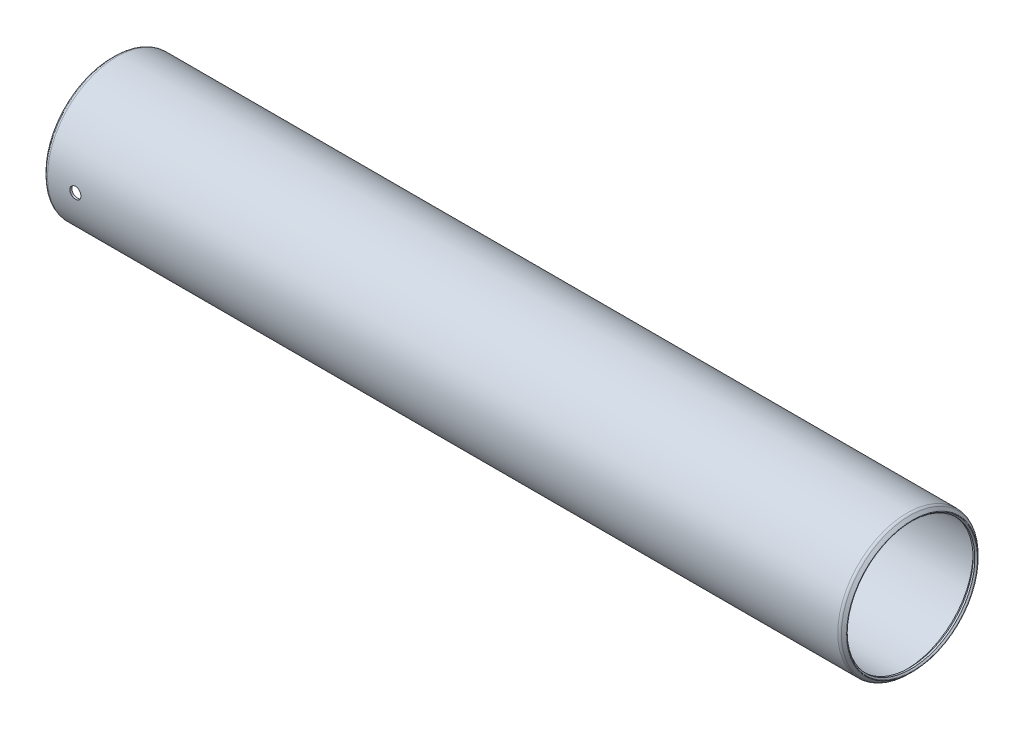
ISO-10303-21;
HEADER;
FILE_DESCRIPTION(('STEP AP214'),'2;1');
FILE_NAME('part.step','',(''),(''),'','','');
FILE_SCHEMA(('AUTOMOTIVE_DESIGN { 1 0 10303 214 1 1 1 1 }'));
ENDSEC;
DATA;
#1=APPLICATION_CONTEXT('core data for automotive mechanical design processes');
#2=APPLICATION_PROTOCOL_DEFINITION('international standard','automotive_design',2000,#1);
#3=PRODUCT_CONTEXT('',#1,'mechanical');
#4=PRODUCT('Part','Part','',(#3));
#5=PRODUCT_RELATED_PRODUCT_CATEGORY('part','',(#4));
#6=PRODUCT_DEFINITION_FORMATION('','',#4);
#7=PRODUCT_DEFINITION_CONTEXT('part definition',#1,'design');
#8=PRODUCT_DEFINITION('design','',#6,#7);
#9=PRODUCT_DEFINITION_SHAPE('','',#8);
#10=(LENGTH_UNIT() NAMED_UNIT(*) SI_UNIT(.MILLI.,.METRE.));
#11=(NAMED_UNIT(*) PLANE_ANGLE_UNIT() SI_UNIT($,.RADIAN.));
#12=(NAMED_UNIT(*) SI_UNIT($,.STERADIAN.) SOLID_ANGLE_UNIT());
#13=UNCERTAINTY_MEASURE_WITH_UNIT(LENGTH_MEASURE(1.E-05),#10,'distance_accuracy_value','');
#14=(GEOMETRIC_REPRESENTATION_CONTEXT(3) GLOBAL_UNCERTAINTY_ASSIGNED_CONTEXT((#13)) GLOBAL_UNIT_ASSIGNED_CONTEXT((#10,
#11,#12)) REPRESENTATION_CONTEXT('',''));
#15=CARTESIAN_POINT('',(0.,0.,0.));
#16=DIRECTION('',(0.,0.,1.));
#17=DIRECTION('',(1.,0.,0.));
#18=AXIS2_PLACEMENT_3D('',#15,#16,#17);
#19=CARTESIAN_POINT('',(226.1362,0.,0.));
#20=DIRECTION('',(-1.,0.,0.));
#21=DIRECTION('',(0.,0.,1.));
#22=AXIS2_PLACEMENT_3D('',#19,#20,#21);
#23=CYLINDRICAL_SURFACE('',#22,19.19605);
#24=CARTESIAN_POINT('',(1.01599999999999,0.,0.));
#25=DIRECTION('',(-1.,0.,0.));
#26=DIRECTION('',(0.,0.,1.));
#27=AXIS2_PLACEMENT_3D('',#24,#25,#26);
#28=CIRCLE('',#27,19.19605);
#29=CARTESIAN_POINT('',(1.01599999999999,0.,19.19605));
#30=VERTEX_POINT('',#29);
#31=EDGE_CURVE('E56',#30,#30,#28,.T.);
#32=ORIENTED_EDGE('',*,*,#31,.T.);
#33=EDGE_LOOP('',(#32));
#34=FACE_BOUND('',#33,.T.);
#35=CARTESIAN_POINT('',(225.1202,0.,0.));
#36=DIRECTION('',(-1.,0.,0.));
#37=DIRECTION('',(0.,0.,1.));
#38=AXIS2_PLACEMENT_3D('',#35,#36,#37);
#39=CIRCLE('',#38,19.19605);
#40=CARTESIAN_POINT('',(225.1202,0.,19.19605));
#41=VERTEX_POINT('',#40);
#42=EDGE_CURVE('E59',#41,#41,#39,.T.);
#43=ORIENTED_EDGE('',*,*,#42,.F.);
#44=EDGE_LOOP('',(#43));
#45=FACE_BOUND('',#44,.T.);
#46=CARTESIAN_POINT('',(10.0965,0.,19.19605));
#47=CARTESIAN_POINT('',(10.0964961113122,-0.0890074222129965,19.1960491395505));
#48=CARTESIAN_POINT('',(10.088989163597,-0.178075496815842,19.1954243411271));
#49=CARTESIAN_POINT('',(10.0591529011164,-0.353747484832783,19.1929919687026));
#50=CARTESIAN_POINT('',(10.0368067777674,-0.440348487608511,19.1911830534657));
#51=CARTESIAN_POINT('',(9.97794262679748,-0.608516619264481,19.1865868713026));
#52=CARTESIAN_POINT('',(9.94143259915656,-0.690086559673568,19.1838001567364));
#53=CARTESIAN_POINT('',(9.85529129123364,-0.845920777775806,19.1775609226845));
#54=CARTESIAN_POINT('',(9.80566282450019,-0.920186617319443,19.1741085460081));
#55=CARTESIAN_POINT('',(9.69455870696838,-1.05951065901766,19.1669157121716));
#56=CARTESIAN_POINT('',(9.63305691504421,-1.12454798450246,19.1631746304945));
#57=CARTESIAN_POINT('',(9.50000715404754,-1.24338972237844,19.1558312730525));
#58=CARTESIAN_POINT('',(9.42845874463818,-1.29719364215941,19.1522290033806));
#59=CARTESIAN_POINT('',(9.27722056541005,-1.39211176295526,19.145564390986));
#60=CARTESIAN_POINT('',(9.19751926019571,-1.43320764362735,19.1425028304679));
#61=CARTESIAN_POINT('',(9.03231812350134,-1.50142609084204,19.1372733870594));
#62=CARTESIAN_POINT('',(8.94681839307541,-1.52854890083448,19.135105488599));
#63=CARTESIAN_POINT('',(8.77265638793106,-1.56799080892642,19.1319140480562));
#64=CARTESIAN_POINT('',(8.6840018567651,-1.58034388393273,19.1308878798697));
#65=CARTESIAN_POINT('',(8.50587220357372,-1.59000062532685,19.1300877757129));
#66=CARTESIAN_POINT('',(8.41639709676722,-1.58730457026422,19.130313816565));
#67=CARTESIAN_POINT('',(8.23939895913984,-1.56696766752186,19.1319902054514));
#68=CARTESIAN_POINT('',(8.15187165350815,-1.54936374063515,19.1334375288293));
#69=CARTESIAN_POINT('',(7.98101838693685,-1.49976816197269,19.1373886585166));
#70=CARTESIAN_POINT('',(7.8976924664935,-1.46777637154484,19.1398924750071));
#71=CARTESIAN_POINT('',(7.73748959602536,-1.39027183729302,19.1456779508023));
#72=CARTESIAN_POINT('',(7.66062069869992,-1.34474252240601,19.1489605624163));
#73=CARTESIAN_POINT('',(7.51560196248796,-1.24146729782351,19.1559328740965));
#74=CARTESIAN_POINT('',(7.44745229751049,-1.18372114451856,19.1596225822795));
#75=CARTESIAN_POINT('',(7.32159186485699,-1.05744433595101,19.1670067983188));
#76=CARTESIAN_POINT('',(7.26391311653701,-0.988881760963037,19.1707012872237));
#77=CARTESIAN_POINT('',(7.16087935245479,-0.843029727379818,19.1776682050059));
#78=CARTESIAN_POINT('',(7.11552434476358,-0.765740263069236,19.1809406336067));
#79=CARTESIAN_POINT('',(7.0384275423161,-0.604607651482987,19.1866953243406));
#80=CARTESIAN_POINT('',(7.00668715858854,-0.520763825973057,19.189177504565));
#81=CARTESIAN_POINT('',(6.9577429797548,-0.348912033182216,19.1930710787476));
#82=CARTESIAN_POINT('',(6.94053888753852,-0.260904151050099,19.1944824945914));
#83=CARTESIAN_POINT('',(6.92119578148437,-0.0835000142768738,19.1960727014375));
#84=CARTESIAN_POINT('',(6.91901253914679,0.00589138690385961,19.1962551111833));
#85=CARTESIAN_POINT('',(6.92965725431218,0.183768946083021,19.1953764166396));
#86=CARTESIAN_POINT('',(6.94248507394823,0.272255112387918,19.1943153237709));
#87=CARTESIAN_POINT('',(6.98275112165342,0.445684345386537,19.1910712881525));
#88=CARTESIAN_POINT('',(7.01016885639667,0.530632202049268,19.1888899191177));
#89=CARTESIAN_POINT('',(7.0788155179294,0.694721813967282,19.1836503922478));
#90=CARTESIAN_POINT('',(7.12004465987255,0.773863478750466,19.180592220754));
#91=CARTESIAN_POINT('',(7.2152549878382,0.924295483852948,19.17393291797));
#92=CARTESIAN_POINT('',(7.26926548266695,0.995567218473713,19.1703305457476));
#93=CARTESIAN_POINT('',(7.38846300753593,1.12804842472744,19.1629917602439));
#94=CARTESIAN_POINT('',(7.45365022881455,1.18925772415288,19.1592553446699));
#95=CARTESIAN_POINT('',(7.59354266571577,1.30002819740439,19.1520588859122));
#96=CARTESIAN_POINT('',(7.66827077115137,1.34956051525263,19.148599541052));
#97=CARTESIAN_POINT('',(7.82500974368063,1.43537314491839,19.1423587510496));
#98=CARTESIAN_POINT('',(7.90702053899709,1.47165358732655,19.1395772992272));
#99=CARTESIAN_POINT('',(8.07589461910256,1.52988341604695,19.1350111115402));
#100=CARTESIAN_POINT('',(8.16275177248435,1.55185048390261,19.1332251463308));
#101=CARTESIAN_POINT('',(8.33893701572026,1.58088757290765,19.1308480123298));
#102=CARTESIAN_POINT('',(8.42826505889114,1.58795787531139,19.1302568209806));
#103=CARTESIAN_POINT('',(8.60656961038509,1.58699750463947,19.1303364931307));
#104=CARTESIAN_POINT('',(8.69554636812239,1.57901217160341,19.1310035673664));
#105=CARTESIAN_POINT('',(8.87089046205487,1.54826172802635,19.1335165573946));
#106=CARTESIAN_POINT('',(8.95725779423916,1.5254965947689,19.135362474999));
#107=CARTESIAN_POINT('',(9.12493446708571,1.46584421345285,19.1400241668074));
#108=CARTESIAN_POINT('',(9.20624409298011,1.42895776261466,19.1428398862603));
#109=CARTESIAN_POINT('',(9.36152399709343,1.3421149298616,19.1491240037773));
#110=CARTESIAN_POINT('',(9.4354943930582,1.29215875767562,19.152592391368));
#111=CARTESIAN_POINT('',(9.57422807143714,1.180424242235,19.1598034576755));
#112=CARTESIAN_POINT('',(9.63896429192961,1.11861234703799,19.1635468957844));
#113=CARTESIAN_POINT('',(9.7571689826063,0.984981513107922,19.1708793458728));
#114=CARTESIAN_POINT('',(9.81063472154976,0.913160155712818,19.1744683202529));
#115=CARTESIAN_POINT('',(9.90485126599172,0.761412740785531,19.1810938321776));
#116=CARTESIAN_POINT('',(9.94557850448037,0.681472019520879,19.1841293415029));
#117=CARTESIAN_POINT('',(10.0129802603482,0.515916464190458,19.1892937960809));
#118=CARTESIAN_POINT('',(10.0396709416609,0.4303082850676,19.1914237835518));
#119=CARTESIAN_POINT('',(10.0714395453713,0.286828698182522,19.1939900112883));
#120=CARTESIAN_POINT('',(10.0808247366306,0.229880195318857,19.1947589932041));
#121=CARTESIAN_POINT('',(10.0933562153964,0.115296278476608,19.1957892656066));
#122=CARTESIAN_POINT('',(10.0965025191731,0.0576608662897922,19.1960505574171));
#123=CARTESIAN_POINT('',(10.0965,0.,19.19605));
#124=B_SPLINE_CURVE_WITH_KNOTS('',3,(#46,#47,#48,#49,#50,#51,#52,#53,#54,#55,#56,#57,#58,#59,
#60,#61,#62,#63,#64,#65,#66,#67,#68,#69,#70,#71,#72,#73,#74,#75,#76,#77,#78,#79,#80,#81,#82,#83,
#84,#85,#86,#87,#88,#89,#90,#91,#92,#93,#94,#95,#96,#97,#98,#99,#100,#101,#102,#103,#104,#105,
#106,#107,#108,#109,#110,#111,#112,#113,#114,#115,#116,#117,#118,#119,#120,#121,#122,#123),
.UNSPECIFIED.,.T.,.F.,(4,2,2,2,2,2,2,2,2,2,2,2,2,2,2,2,2,2,2,2,2,2,2,2,2,2,2,2,2,2,2,2,2,2,2,2,
2,2,4),(0.,0.266811742417537,0.533926223670003,0.800890053902696,1.06779667404269,
1.33529777742987,1.60281060888184,1.87070731712296,2.13859935769895,2.40587393531706,
2.67314356587382,2.93975320649116,3.20636541641133,3.47330533504324,3.74025057708342,
4.00799885267469,4.27574730361823,4.54352349748899,4.81129421809739,5.07827615610076,
5.34525564206643,5.61186110863492,5.87847072856863,6.14569773613796,6.41292931652792,
6.68081451075077,6.94869706502698,7.21624806909117,7.48379402168561,7.75053554646066,
8.01727748121679,8.28400435925018,8.55072695739864,8.81821583083241,9.08576945205549,
9.35381517547175,9.621551548575,9.79439821622158,9.96724443310526),.UNSPECIFIED.);
#125=CARTESIAN_POINT('',(10.0965,0.,19.19605));
#126=VERTEX_POINT('',#125);
#127=EDGE_CURVE('E89',#126,#126,#124,.T.);
#128=ORIENTED_EDGE('',*,*,#127,.F.);
#129=EDGE_LOOP('',(#128));
#130=FACE_BOUND('',#129,.T.);
#131=ADVANCED_FACE('F32',(#34,#45,#130),#23,.F.);
#132=CARTESIAN_POINT('',(226.1362,0.,0.));
#133=DIRECTION('',(-1.,0.,0.));
#134=DIRECTION('',(0.,0.,1.));
#135=AXIS2_PLACEMENT_3D('',#132,#133,#134);
#136=CYLINDRICAL_SURFACE('',#135,19.7675499999996);
#137=CARTESIAN_POINT('',(0.571500000002945,0.,0.));
#138=DIRECTION('',(-1.,0.,0.));
#139=DIRECTION('',(0.,0.,1.));
#140=AXIS2_PLACEMENT_3D('',#137,#138,#139);
#141=CIRCLE('',#140,19.7675499999996);
#142=CARTESIAN_POINT('',(0.571500000002945,0.,19.7675499999996));
#143=VERTEX_POINT('',#142);
#144=EDGE_CURVE('E80',#143,#143,#141,.T.);
#145=ORIENTED_EDGE('',*,*,#144,.F.);
#146=EDGE_LOOP('',(#145));
#147=FACE_BOUND('',#146,.T.);
#148=CARTESIAN_POINT('',(225.564699999988,0.,0.));
#149=DIRECTION('',(-1.,0.,0.));
#150=DIRECTION('',(0.,0.,1.));
#151=AXIS2_PLACEMENT_3D('',#148,#149,#150);
#152=CIRCLE('',#151,19.7675499999997);
#153=CARTESIAN_POINT('',(225.564699999988,0.,19.7675499999997));
#154=VERTEX_POINT('',#153);
#155=EDGE_CURVE('E77',#154,#154,#152,.T.);
#156=ORIENTED_EDGE('',*,*,#155,.T.);
#157=EDGE_LOOP('',(#156));
#158=FACE_BOUND('',#157,.T.);
#159=CARTESIAN_POINT('',(6.9215,0.,19.7675499999996));
#160=CARTESIAN_POINT('',(6.92150389299718,-0.0890166962575189,19.7675491628144));
#161=CARTESIAN_POINT('',(6.92901239851269,-0.178094273461463,19.7669423003108));
#162=CARTESIAN_POINT('',(6.95885521019026,-0.353785639888516,19.7645797525852));
#163=CARTESIAN_POINT('',(6.98120638779648,-0.440396508267634,19.7628227600599));
#164=CARTESIAN_POINT('',(7.04008474630661,-0.608584415858349,19.7583585359442));
#165=CARTESIAN_POINT('',(7.07660399429788,-0.690164242452447,19.75565183619));
#166=CARTESIAN_POINT('',(7.16276786310389,-0.846016295404356,19.749591883618));
#167=CARTESIAN_POINT('',(7.21240964413927,-0.920290098055068,19.7462387707296));
#168=CARTESIAN_POINT('',(7.32353711241895,-1.05961816495716,19.7392534427118));
#169=CARTESIAN_POINT('',(7.38504753528391,-1.12465267317521,19.7356206543797));
#170=CARTESIAN_POINT('',(7.51811410515099,-1.24348662022431,19.7284902352223));
#171=CARTESIAN_POINT('',(7.58967068962398,-1.29728556953702,19.7249926102913));
#172=CARTESIAN_POINT('',(7.74091706601682,-1.39218741440558,19.7185222826054));
#173=CARTESIAN_POINT('',(7.82061771504056,-1.43327305981008,19.715550295387));
#174=CARTESIAN_POINT('',(7.9858140809978,-1.5014718161816,19.710474162225));
#175=CARTESIAN_POINT('',(8.07130970210467,-1.52858515813328,19.7083700019349));
#176=CARTESIAN_POINT('',(8.24547201296185,-1.56801264505266,19.7052724843792));
#177=CARTESIAN_POINT('',(8.33413140428771,-1.58035883717485,19.7042767220343));
#178=CARTESIAN_POINT('',(8.51226924961437,-1.59000055324565,19.7035011062052));
#179=CARTESIAN_POINT('',(8.60174768921082,-1.58729634137497,19.7037212313785));
#180=CARTESIAN_POINT('',(8.77876425439568,-1.56694051286769,19.7053503371027));
#181=CARTESIAN_POINT('',(8.8663064112415,-1.5493237000245,19.706756549475));
#182=CARTESIAN_POINT('',(9.03718721904829,-1.49969680346839,19.7105950357182));
#183=CARTESIAN_POINT('',(9.12052583151671,-1.46768658797928,19.7130273189831));
#184=CARTESIAN_POINT('',(9.28074493669408,-1.39014248191556,19.7186470685147));
#185=CARTESIAN_POINT('',(9.35761782648448,-1.34459294824651,19.7218354074487));
#186=CARTESIAN_POINT('',(9.5026402089271,-1.24127447507075,19.7286071969871));
#187=CARTESIAN_POINT('',(9.57078953765133,-1.18350530599399,19.732190655014));
#188=CARTESIAN_POINT('',(9.69663267498539,-1.0571920791852,19.7393612173894));
#189=CARTESIAN_POINT('',(9.75429628307379,-0.988617927971912,19.7429483032568));
#190=CARTESIAN_POINT('',(9.85729770757285,-0.842746375404617,19.749712240216));
#191=CARTESIAN_POINT('',(9.9026355164982,-0.765448968753112,19.7528890910588));
#192=CARTESIAN_POINT('',(9.97969637934253,-0.60430567734342,19.7584751503597));
#193=CARTESIAN_POINT('',(10.0114181272265,-0.520459165314777,19.7608842851739));
#194=CARTESIAN_POINT('',(10.0603254180698,-0.348606631719726,19.7646626010053));
#195=CARTESIAN_POINT('',(10.0775112411916,-0.260600690355843,19.766031802066));
#196=CARTESIAN_POINT('',(10.0968210478638,-0.0831892776828254,19.767573403357));
#197=CARTESIAN_POINT('',(10.0989867527167,0.00621162503335007,19.7677491186981));
#198=CARTESIAN_POINT('',(10.0883040954543,0.184105267809205,19.7668927981104));
#199=CARTESIAN_POINT('',(10.0754558632628,0.272598015720956,19.7658607726327));
#200=CARTESIAN_POINT('',(10.0351446203948,0.44604463653064,19.7627071845965));
#201=CARTESIAN_POINT('',(10.0077009161802,0.531003024876763,19.760587061471));
#202=CARTESIAN_POINT('',(9.93899745585498,0.695109060394033,19.7554955020401));
#203=CARTESIAN_POINT('',(9.89773749642156,0.774256622031003,19.7525240532066));
#204=CARTESIAN_POINT('',(9.80246767648198,0.924684356429668,19.7460548025642));
#205=CARTESIAN_POINT('',(9.74843013962268,0.995946951405215,19.7425558642559));
#206=CARTESIAN_POINT('',(9.62917912100352,1.12840451131813,19.735428669885));
#207=CARTESIAN_POINT('',(9.56396545889798,1.1895993137634,19.7318004117363));
#208=CARTESIAN_POINT('',(9.42403248951573,1.30032701532646,19.7248137225842));
#209=CARTESIAN_POINT('',(9.34929162269615,1.34983271445025,19.7214559326696));
#210=CARTESIAN_POINT('',(9.19253334362868,1.43559049791968,19.7153992861098));
#211=CARTESIAN_POINT('',(9.11051599958621,1.47184270647947,19.712700423289));
#212=CARTESIAN_POINT('',(8.94162974250711,1.53001798238323,19.7082707012478));
#213=CARTESIAN_POINT('',(8.85476662205897,1.55195777643513,19.7065387123989));
#214=CARTESIAN_POINT('',(8.67857503343257,1.58093992028697,19.7042349928411));
#215=CARTESIAN_POINT('',(8.58924660887568,1.5879825335082,19.7036632416162));
#216=CARTESIAN_POINT('',(8.41093044197579,1.5869674511939,19.7037450036221));
#217=CARTESIAN_POINT('',(8.32194245161323,1.57895249587738,19.7043950488421));
#218=CARTESIAN_POINT('',(8.14658067866693,1.54813883148153,19.7068397941792));
#219=CARTESIAN_POINT('',(8.06020690021273,1.5253400990503,19.7086344961042));
#220=CARTESIAN_POINT('',(7.89252205597485,1.46561670491894,19.7131654299181));
#221=CARTESIAN_POINT('',(7.8112107452595,1.42869272724312,19.7159016162142));
#222=CARTESIAN_POINT('',(7.65593437763611,1.34177188183597,19.7220072770421));
#223=CARTESIAN_POINT('',(7.58196919332007,1.29177524088584,19.7253767405877));
#224=CARTESIAN_POINT('',(7.44326611995575,1.17996786123079,19.7323806465514));
#225=CARTESIAN_POINT('',(7.37855371903605,1.11812554669812,19.7360157807521));
#226=CARTESIAN_POINT('',(7.26040214498091,0.98443812628297,19.7431351473834));
#227=CARTESIAN_POINT('',(7.20696570816124,0.912590599460787,19.7466193430233));
#228=CARTESIAN_POINT('',(7.11281667742046,0.760803180001646,19.7530500894224));
#229=CARTESIAN_POINT('',(7.07212661342311,0.680849285306309,19.7559956843931));
#230=CARTESIAN_POINT('',(7.0048004715457,0.515275766229644,19.7610059343809));
#231=CARTESIAN_POINT('',(6.97814818905611,0.429662803548266,19.7630716046159));
#232=CARTESIAN_POINT('',(6.94646474513532,0.286284718060395,19.7655571680099));
#233=CARTESIAN_POINT('',(6.93711535351396,0.229442492831018,19.7663010911564));
#234=CARTESIAN_POINT('',(6.92463173007888,0.115075326260278,19.7672977771784));
#235=CARTESIAN_POINT('',(6.92149748312955,0.0575503865818561,19.7675505412502));
#236=CARTESIAN_POINT('',(6.9215,0.,19.7675499999996));
#237=B_SPLINE_CURVE_WITH_KNOTS('',3,(#159,#160,#161,#162,#163,#164,#165,#166,#167,#168,#169,
#170,#171,#172,#173,#174,#175,#176,#177,#178,#179,#180,#181,#182,#183,#184,#185,#186,#187,#188,
#189,#190,#191,#192,#193,#194,#195,#196,#197,#198,#199,#200,#201,#202,#203,#204,#205,#206,#207,
#208,#209,#210,#211,#212,#213,#214,#215,#216,#217,#218,#219,#220,#221,#222,#223,#224,#225,#226,
#227,#228,#229,#230,#231,#232,#233,#234,#235,#236),.UNSPECIFIED.,.T.,.F.,(4,2,2,2,2,2,2,2,2,2,2,
2,2,2,2,2,2,2,2,2,2,2,2,2,2,2,2,2,2,2,2,2,2,2,2,2,2,2,4),(0.,0.266839971703868,
0.533983776799431,0.800978219491308,1.06791493053283,1.33541409769941,1.60292491701864,
1.87079713488918,2.13866492425875,2.40595033538419,2.67323105484635,2.93988969523907,
3.20655077702659,3.47352115997886,3.74049655894396,4.00822911364488,4.2759618309364,
4.54372022306998,4.81147345436464,5.07848264999195,5.34548953506095,5.61214410651735,
5.8788026022877,6.14604406092532,6.41328983236209,6.68115147502021,6.94901060716583,
7.21655613279339,7.48409692747349,7.75087946700323,8.01766242793367,8.28443247135816,
8.55119788723115,8.81868454582298,9.08623604041261,9.35425781301461,9.62196951097252,
9.79448524757846,9.96700056406047),.UNSPECIFIED.);
#238=CARTESIAN_POINT('',(6.9215,0.,19.7675499999996));
#239=VERTEX_POINT('',#238);
#240=EDGE_CURVE('E10',#239,#239,#237,.T.);
#241=ORIENTED_EDGE('',*,*,#240,.F.);
#242=EDGE_LOOP('',(#241));
#243=FACE_BOUND('',#242,.T.);
#244=ADVANCED_FACE('F110',(#147,#158,#243),#136,.T.);
#245=CARTESIAN_POINT('',(-0.792815367264612,0.,0.));
#246=DIRECTION('',(-1.,0.,0.));
#247=DIRECTION('',(0.,0.,1.));
#248=AXIS2_PLACEMENT_3D('',#245,#246,#247);
#249=TOROIDAL_SURFACE('',#248,18.6444704896855,0.126999999999538);
#250=CARTESIAN_POINT('',(-0.882617928474827,0.,0.));
#251=DIRECTION('',(-1.,0.,0.));
#252=DIRECTION('',(0.,0.,1.));
#253=AXIS2_PLACEMENT_3D('',#250,#251,#252);
#254=CIRCLE('',#253,18.554667928475);
#255=CARTESIAN_POINT('',(-0.882617928474827,0.,18.554667928475));
#256=VERTEX_POINT('',#255);
#257=EDGE_CURVE('E43',#256,#256,#254,.T.);
#258=ORIENTED_EDGE('',*,*,#257,.F.);
#259=EDGE_LOOP('',(#258));
#260=FACE_BOUND('',#259,.T.);
#261=CARTESIAN_POINT('',(-0.882617928474827,0.,0.));
#262=DIRECTION('',(-1.,0.,0.));
#263=DIRECTION('',(0.,0.,1.));
#264=AXIS2_PLACEMENT_3D('',#261,#262,#263);
#265=CIRCLE('',#264,18.734273050896);
#266=CARTESIAN_POINT('',(-0.882617928474827,0.,18.734273050896));
#267=VERTEX_POINT('',#266);
#268=EDGE_CURVE('E86',#267,#267,#265,.T.);
#269=ORIENTED_EDGE('',*,*,#268,.T.);
#270=EDGE_LOOP('',(#269));
#271=FACE_BOUND('',#270,.T.);
#272=ADVANCED_FACE('F34',(#260,#271),#249,.T.);
#273=CARTESIAN_POINT('',(-0.882617928474827,0.,0.));
#274=DIRECTION('',(-1.,0.,0.));
#275=DIRECTION('',(0.,0.,1.));
#276=AXIS2_PLACEMENT_3D('',#273,#274,#275);
#277=CONICAL_SURFACE('',#276,18.554667928475,0.785398163397684);
#278=CARTESIAN_POINT('',(-0.508000000000008,0.,0.));
#279=DIRECTION('',(-1.,0.,0.));
#280=DIRECTION('',(0.,0.,1.));
#281=AXIS2_PLACEMENT_3D('',#278,#279,#280);
#282=CIRCLE('',#281,18.18005);
#283=CARTESIAN_POINT('',(-0.508000000000008,0.,18.18005));
#284=VERTEX_POINT('',#283);
#285=EDGE_CURVE('E47',#284,#284,#282,.T.);
#286=ORIENTED_EDGE('',*,*,#285,.F.);
#287=EDGE_LOOP('',(#286));
#288=FACE_BOUND('',#287,.T.);
#289=ORIENTED_EDGE('',*,*,#257,.T.);
#290=EDGE_LOOP('',(#289));
#291=FACE_BOUND('',#290,.T.);
#292=ADVANCED_FACE('F159',(#288,#291),#277,.F.);
#293=CARTESIAN_POINT('',(226.1362,0.,0.));
#294=DIRECTION('',(-1.,0.,0.));
#295=DIRECTION('',(0.,0.,1.));
#296=AXIS2_PLACEMENT_3D('',#293,#294,#295);
#297=CYLINDRICAL_SURFACE('',#296,18.18005);
#298=CARTESIAN_POINT('',(0.,0.,0.));
#299=DIRECTION('',(-1.,0.,0.));
#300=DIRECTION('',(0.,0.,1.));
#301=AXIS2_PLACEMENT_3D('',#298,#299,#300);
#302=CIRCLE('',#301,18.18005);
#303=CARTESIAN_POINT('',(0.,0.,18.18005));
#304=VERTEX_POINT('',#303);
#305=EDGE_CURVE('E51',#304,#304,#302,.T.);
#306=ORIENTED_EDGE('',*,*,#305,.F.);
#307=EDGE_LOOP('',(#306));
#308=FACE_BOUND('',#307,.T.);
#309=ORIENTED_EDGE('',*,*,#285,.T.);
#310=EDGE_LOOP('',(#309));
#311=FACE_BOUND('',#310,.T.);
#312=ADVANCED_FACE('F140',(#308,#311),#297,.F.);
#313=CARTESIAN_POINT('',(0.,0.,0.));
#314=DIRECTION('',(1.,0.,0.));
#315=DIRECTION('',(0.,0.,-1.));
#316=AXIS2_PLACEMENT_3D('',#313,#314,#315);
#317=CONICAL_SURFACE('',#316,18.18005,0.785398163397452);
#318=ORIENTED_EDGE('',*,*,#31,.F.);
#319=EDGE_LOOP('',(#318));
#320=FACE_BOUND('',#319,.T.);
#321=ORIENTED_EDGE('',*,*,#305,.T.);
#322=EDGE_LOOP('',(#321));
#323=FACE_BOUND('',#322,.T.);
#324=ADVANCED_FACE('F135',(#320,#323),#317,.F.);
#325=CARTESIAN_POINT('',(225.1202,0.,0.));
#326=DIRECTION('',(-1.,0.,0.));
#327=DIRECTION('',(0.,0.,1.));
#328=AXIS2_PLACEMENT_3D('',#325,#326,#327);
#329=CONICAL_SURFACE('',#328,19.19605,0.785398163397452);
#330=CARTESIAN_POINT('',(226.1362,0.,0.));
#331=DIRECTION('',(-1.,0.,0.));
#332=DIRECTION('',(0.,0.,1.));
#333=AXIS2_PLACEMENT_3D('',#330,#331,#332);
#334=CIRCLE('',#333,18.18005);
#335=CARTESIAN_POINT('',(226.1362,0.,18.18005));
#336=VERTEX_POINT('',#335);
#337=EDGE_CURVE('E62',#336,#336,#334,.T.);
#338=ORIENTED_EDGE('',*,*,#337,.F.);
#339=EDGE_LOOP('',(#338));
#340=FACE_BOUND('',#339,.T.);
#341=ORIENTED_EDGE('',*,*,#42,.T.);
#342=EDGE_LOOP('',(#341));
#343=FACE_BOUND('',#342,.T.);
#344=ADVANCED_FACE('F132',(#340,#343),#329,.F.);
#345=CARTESIAN_POINT('',(226.1362,0.,0.));
#346=DIRECTION('',(-1.,0.,0.));
#347=DIRECTION('',(0.,0.,1.));
#348=AXIS2_PLACEMENT_3D('',#345,#346,#347);
#349=CYLINDRICAL_SURFACE('',#348,18.18005);
#350=CARTESIAN_POINT('',(226.6442,0.,0.));
#351=DIRECTION('',(-1.,0.,0.));
#352=DIRECTION('',(0.,0.,1.));
#353=AXIS2_PLACEMENT_3D('',#350,#351,#352);
#354=CIRCLE('',#353,18.18005);
#355=CARTESIAN_POINT('',(226.6442,0.,18.18005));
#356=VERTEX_POINT('',#355);
#357=EDGE_CURVE('E65',#356,#356,#354,.T.);
#358=ORIENTED_EDGE('',*,*,#357,.F.);
#359=EDGE_LOOP('',(#358));
#360=FACE_BOUND('',#359,.T.);
#361=ORIENTED_EDGE('',*,*,#337,.T.);
#362=EDGE_LOOP('',(#361));
#363=FACE_BOUND('',#362,.T.);
#364=ADVANCED_FACE('F129',(#360,#363),#349,.F.);
#365=CARTESIAN_POINT('',(226.6442,0.,0.));
#366=DIRECTION('',(1.,0.,0.));
#367=DIRECTION('',(0.,0.,-1.));
#368=AXIS2_PLACEMENT_3D('',#365,#366,#367);
#369=CONICAL_SURFACE('',#368,18.18005,0.785398163397462);
#370=CARTESIAN_POINT('',(227.018817928479,0.,0.));
#371=DIRECTION('',(-1.,0.,0.));
#372=DIRECTION('',(0.,0.,1.));
#373=AXIS2_PLACEMENT_3D('',#370,#371,#372);
#374=CIRCLE('',#373,18.5546679284786);
#375=CARTESIAN_POINT('',(227.018817928479,0.,18.5546679284786));
#376=VERTEX_POINT('',#375);
#377=EDGE_CURVE('E68',#376,#376,#374,.T.);
#378=ORIENTED_EDGE('',*,*,#377,.F.);
#379=EDGE_LOOP('',(#378));
#380=FACE_BOUND('',#379,.T.);
#381=ORIENTED_EDGE('',*,*,#357,.T.);
#382=EDGE_LOOP('',(#381));
#383=FACE_BOUND('',#382,.T.);
#384=ADVANCED_FACE('F125',(#380,#383),#369,.F.);
#385=CARTESIAN_POINT('',(226.929015367269,0.,0.));
#386=DIRECTION('',(-1.,0.,0.));
#387=DIRECTION('',(0.,0.,1.));
#388=AXIS2_PLACEMENT_3D('',#385,#386,#387);
#389=TOROIDAL_SURFACE('',#388,18.6444704896878,0.126999999997879);
#390=CARTESIAN_POINT('',(227.018817928479,0.,0.));
#391=DIRECTION('',(-1.,0.,0.));
#392=DIRECTION('',(0.,0.,1.));
#393=AXIS2_PLACEMENT_3D('',#390,#391,#392);
#394=CIRCLE('',#393,18.734273050897);
#395=CARTESIAN_POINT('',(227.018817928479,0.,18.734273050897));
#396=VERTEX_POINT('',#395);
#397=EDGE_CURVE('E71',#396,#396,#394,.T.);
#398=ORIENTED_EDGE('',*,*,#397,.F.);
#399=EDGE_LOOP('',(#398));
#400=FACE_BOUND('',#399,.T.);
#401=ORIENTED_EDGE('',*,*,#377,.T.);
#402=EDGE_LOOP('',(#401));
#403=FACE_BOUND('',#402,.T.);
#404=ADVANCED_FACE('F121',(#400,#403),#389,.T.);
#405=CARTESIAN_POINT('',(227.018817928479,0.,0.));
#406=DIRECTION('',(-1.,0.,0.));
#407=DIRECTION('',(0.,0.,1.));
#408=AXIS2_PLACEMENT_3D('',#405,#406,#407);
#409=CONICAL_SURFACE('',#408,18.734273050897,0.785398163397394);
#410=CARTESIAN_POINT('',(226.283120489703,0.,0.));
#411=DIRECTION('',(-1.,0.,0.));
#412=DIRECTION('',(0.,0.,1.));
#413=AXIS2_PLACEMENT_3D('',#410,#411,#412);
#414=CIRCLE('',#413,19.469970489673);
#415=CARTESIAN_POINT('',(226.283120489703,0.,19.469970489673));
#416=VERTEX_POINT('',#415);
#417=EDGE_CURVE('E74',#416,#416,#414,.T.);
#418=ORIENTED_EDGE('',*,*,#417,.F.);
#419=EDGE_LOOP('',(#418));
#420=FACE_BOUND('',#419,.T.);
#421=ORIENTED_EDGE('',*,*,#397,.T.);
#422=EDGE_LOOP('',(#421));
#423=FACE_BOUND('',#422,.T.);
#424=ADVANCED_FACE('F117',(#420,#423),#409,.T.);
#425=CARTESIAN_POINT('',(225.564699999988,0.,0.));
#426=DIRECTION('',(-1.,0.,0.));
#427=DIRECTION('',(0.,0.,1.));
#428=AXIS2_PLACEMENT_3D('',#425,#426,#427);
#429=TOROIDAL_SURFACE('',#428,18.7515499999584,1.01600000004133);
#430=ORIENTED_EDGE('',*,*,#155,.F.);
#431=EDGE_LOOP('',(#430));
#432=FACE_BOUND('',#431,.T.);
#433=ORIENTED_EDGE('',*,*,#417,.T.);
#434=EDGE_LOOP('',(#433));
#435=FACE_BOUND('',#434,.T.);
#436=ADVANCED_FACE('F108',(#432,#435),#429,.T.);
#437=CARTESIAN_POINT('',(0.57150000000259,0.,0.));
#438=DIRECTION('',(-1.,0.,0.));
#439=DIRECTION('',(0.,0.,1.));
#440=AXIS2_PLACEMENT_3D('',#437,#438,#439);
#441=TOROIDAL_SURFACE('',#440,18.7515499999926,1.01600000000696);
#442=CARTESIAN_POINT('',(-0.146920489687813,0.,0.));
#443=DIRECTION('',(-1.,0.,0.));
#444=DIRECTION('',(0.,0.,1.));
#445=AXIS2_PLACEMENT_3D('',#442,#443,#444);
#446=CIRCLE('',#445,19.469970489683);
#447=CARTESIAN_POINT('',(-0.146920489687813,0.,19.469970489683));
#448=VERTEX_POINT('',#447);
#449=EDGE_CURVE('E83',#448,#448,#446,.T.);
#450=ORIENTED_EDGE('',*,*,#449,.F.);
#451=EDGE_LOOP('',(#450));
#452=FACE_BOUND('',#451,.T.);
#453=ORIENTED_EDGE('',*,*,#144,.T.);
#454=EDGE_LOOP('',(#453));
#455=FACE_BOUND('',#454,.T.);
#456=ADVANCED_FACE('F105',(#452,#455),#441,.T.);
#457=CARTESIAN_POINT('',(-0.146920489687813,0.,0.));
#458=DIRECTION('',(1.,0.,0.));
#459=DIRECTION('',(0.,0.,-1.));
#460=AXIS2_PLACEMENT_3D('',#457,#458,#459);
#461=CONICAL_SURFACE('',#460,19.469970489683,0.78539816339746);
#462=ORIENTED_EDGE('',*,*,#268,.F.);
#463=EDGE_LOOP('',(#462));
#464=FACE_BOUND('',#463,.T.);
#465=ORIENTED_EDGE('',*,*,#449,.T.);
#466=EDGE_LOOP('',(#465));
#467=FACE_BOUND('',#466,.T.);
#468=ADVANCED_FACE('F101',(#464,#467),#461,.T.);
#469=CARTESIAN_POINT('',(8.509,0.,19.76755));
#470=DIRECTION('',(0.,0.,-1.));
#471=DIRECTION('',(-1.,0.,0.));
#472=AXIS2_PLACEMENT_3D('',#469,#470,#471);
#473=CYLINDRICAL_SURFACE('',#472,1.5875);
#474=ORIENTED_EDGE('',*,*,#240,.T.);
#475=EDGE_LOOP('',(#474));
#476=FACE_BOUND('',#475,.T.);
#477=ORIENTED_EDGE('',*,*,#127,.T.);
#478=EDGE_LOOP('',(#477));
#479=FACE_BOUND('',#478,.T.);
#480=ADVANCED_FACE('F97',(#476,#479),#473,.F.);
#481=CLOSED_SHELL('',(#131,#244,#272,#292,#312,#324,#344,#364,#384,#404,#424,#436,#456,#468,#480));
#482=MANIFOLD_SOLID_BREP('B2',#481);
#483=ADVANCED_BREP_SHAPE_REPRESENTATION('',(#18,#482),#14);
#484=SHAPE_DEFINITION_REPRESENTATION(#9,#483);
ENDSEC;
END-ISO-10303-21;
